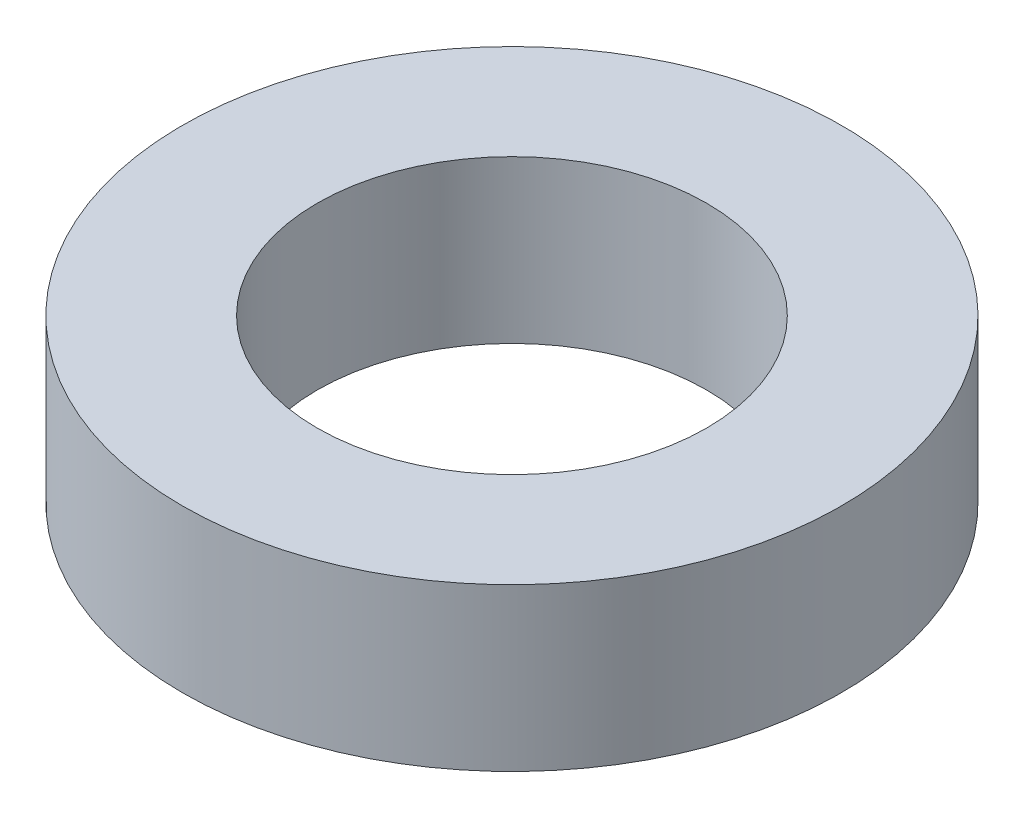
ISO-10303-21;
HEADER;
FILE_DESCRIPTION(('STEP AP214'),'2;1');
FILE_NAME('part.step','',(''),(''),'','','');
FILE_SCHEMA(('AUTOMOTIVE_DESIGN { 1 0 10303 214 1 1 1 1 }'));
ENDSEC;
DATA;
#1=APPLICATION_CONTEXT('core data for automotive mechanical design processes');
#2=APPLICATION_PROTOCOL_DEFINITION('international standard','automotive_design',2000,#1);
#3=PRODUCT_CONTEXT('',#1,'mechanical');
#4=PRODUCT('Part','Part','',(#3));
#5=PRODUCT_RELATED_PRODUCT_CATEGORY('part','',(#4));
#6=PRODUCT_DEFINITION_FORMATION('','',#4);
#7=PRODUCT_DEFINITION_CONTEXT('part definition',#1,'design');
#8=PRODUCT_DEFINITION('design','',#6,#7);
#9=PRODUCT_DEFINITION_SHAPE('','',#8);
#10=(LENGTH_UNIT() NAMED_UNIT(*) SI_UNIT(.MILLI.,.METRE.));
#11=(NAMED_UNIT(*) PLANE_ANGLE_UNIT() SI_UNIT($,.RADIAN.));
#12=(NAMED_UNIT(*) SI_UNIT($,.STERADIAN.) SOLID_ANGLE_UNIT());
#13=UNCERTAINTY_MEASURE_WITH_UNIT(LENGTH_MEASURE(1.E-05),#10,'distance_accuracy_value','');
#14=(GEOMETRIC_REPRESENTATION_CONTEXT(3) GLOBAL_UNCERTAINTY_ASSIGNED_CONTEXT((#13)) GLOBAL_UNIT_ASSIGNED_CONTEXT((#10,
#11,#12)) REPRESENTATION_CONTEXT('',''));
#15=CARTESIAN_POINT('',(0.,0.,0.));
#16=DIRECTION('',(0.,0.,1.));
#17=DIRECTION('',(1.,0.,0.));
#18=AXIS2_PLACEMENT_3D('',#15,#16,#17);
#19=CARTESIAN_POINT('',(0.,27.,0.));
#20=DIRECTION('',(0.,-1.,0.));
#21=DIRECTION('',(0.,0.,-1.));
#22=AXIS2_PLACEMENT_3D('',#19,#20,#21);
#23=CYLINDRICAL_SURFACE('',#22,55.);
#24=CARTESIAN_POINT('',(0.,27.,0.));
#25=DIRECTION('',(0.,1.,0.));
#26=DIRECTION('',(0.,0.,1.));
#27=AXIS2_PLACEMENT_3D('',#24,#25,#26);
#28=CIRCLE('',#27,55.);
#29=CARTESIAN_POINT('',(0.,27.,55.));
#30=VERTEX_POINT('',#29);
#31=EDGE_CURVE('E10',#30,#30,#28,.T.);
#32=ORIENTED_EDGE('',*,*,#31,.F.);
#33=EDGE_LOOP('',(#32));
#34=FACE_BOUND('',#33,.T.);
#35=CARTESIAN_POINT('',(0.,0.,0.));
#36=DIRECTION('',(0.,1.,0.));
#37=DIRECTION('',(0.,0.,1.));
#38=AXIS2_PLACEMENT_3D('',#35,#36,#37);
#39=CIRCLE('',#38,55.);
#40=CARTESIAN_POINT('',(0.,0.,55.));
#41=VERTEX_POINT('',#40);
#42=EDGE_CURVE('E37',#41,#41,#39,.T.);
#43=ORIENTED_EDGE('',*,*,#42,.T.);
#44=EDGE_LOOP('',(#43));
#45=FACE_BOUND('',#44,.T.);
#46=ADVANCED_FACE('F40',(#34,#45),#23,.T.);
#47=CARTESIAN_POINT('',(0.,27.,0.));
#48=DIRECTION('',(0.,1.,0.));
#49=DIRECTION('',(0.,0.,1.));
#50=AXIS2_PLACEMENT_3D('',#47,#48,#49);
#51=PLANE('',#50);
#52=CARTESIAN_POINT('',(0.,27.,0.));
#53=DIRECTION('',(0.,1.,0.));
#54=DIRECTION('',(0.,0.,1.));
#55=AXIS2_PLACEMENT_3D('',#52,#53,#54);
#56=CIRCLE('',#55,32.5);
#57=CARTESIAN_POINT('',(0.,27.,32.5));
#58=VERTEX_POINT('',#57);
#59=EDGE_CURVE('E50',#58,#58,#56,.T.);
#60=ORIENTED_EDGE('',*,*,#59,.F.);
#61=EDGE_LOOP('',(#60));
#62=FACE_BOUND('',#61,.T.);
#63=ORIENTED_EDGE('',*,*,#31,.T.);
#64=EDGE_LOOP('',(#63));
#65=FACE_BOUND('',#64,.T.);
#66=ADVANCED_FACE('F59',(#62,#65),#51,.T.);
#67=CARTESIAN_POINT('',(0.,0.,0.));
#68=DIRECTION('',(0.,1.,0.));
#69=DIRECTION('',(0.,0.,1.));
#70=AXIS2_PLACEMENT_3D('',#67,#68,#69);
#71=PLANE('',#70);
#72=CARTESIAN_POINT('',(0.,0.,0.));
#73=DIRECTION('',(0.,1.,0.));
#74=DIRECTION('',(0.,0.,1.));
#75=AXIS2_PLACEMENT_3D('',#72,#73,#74);
#76=CIRCLE('',#75,32.5);
#77=CARTESIAN_POINT('',(0.,0.,32.5));
#78=VERTEX_POINT('',#77);
#79=EDGE_CURVE('E47',#78,#78,#76,.T.);
#80=ORIENTED_EDGE('',*,*,#79,.T.);
#81=EDGE_LOOP('',(#80));
#82=FACE_BOUND('',#81,.T.);
#83=ORIENTED_EDGE('',*,*,#42,.F.);
#84=EDGE_LOOP('',(#83));
#85=FACE_BOUND('',#84,.T.);
#86=ADVANCED_FACE('F58',(#82,#85),#71,.F.);
#87=CARTESIAN_POINT('',(0.,27.,0.));
#88=DIRECTION('',(0.,-1.,0.));
#89=DIRECTION('',(0.,0.,-1.));
#90=AXIS2_PLACEMENT_3D('',#87,#88,#89);
#91=CYLINDRICAL_SURFACE('',#90,32.5);
#92=ORIENTED_EDGE('',*,*,#59,.T.);
#93=EDGE_LOOP('',(#92));
#94=FACE_BOUND('',#93,.T.);
#95=ORIENTED_EDGE('',*,*,#79,.F.);
#96=EDGE_LOOP('',(#95));
#97=FACE_BOUND('',#96,.T.);
#98=ADVANCED_FACE('F54',(#94,#97),#91,.F.);
#99=CLOSED_SHELL('',(#46,#66,#86,#98));
#100=MANIFOLD_SOLID_BREP('B2',#99);
#101=ADVANCED_BREP_SHAPE_REPRESENTATION('',(#18,#100),#14);
#102=SHAPE_DEFINITION_REPRESENTATION(#9,#101);
ENDSEC;
END-ISO-10303-21;
